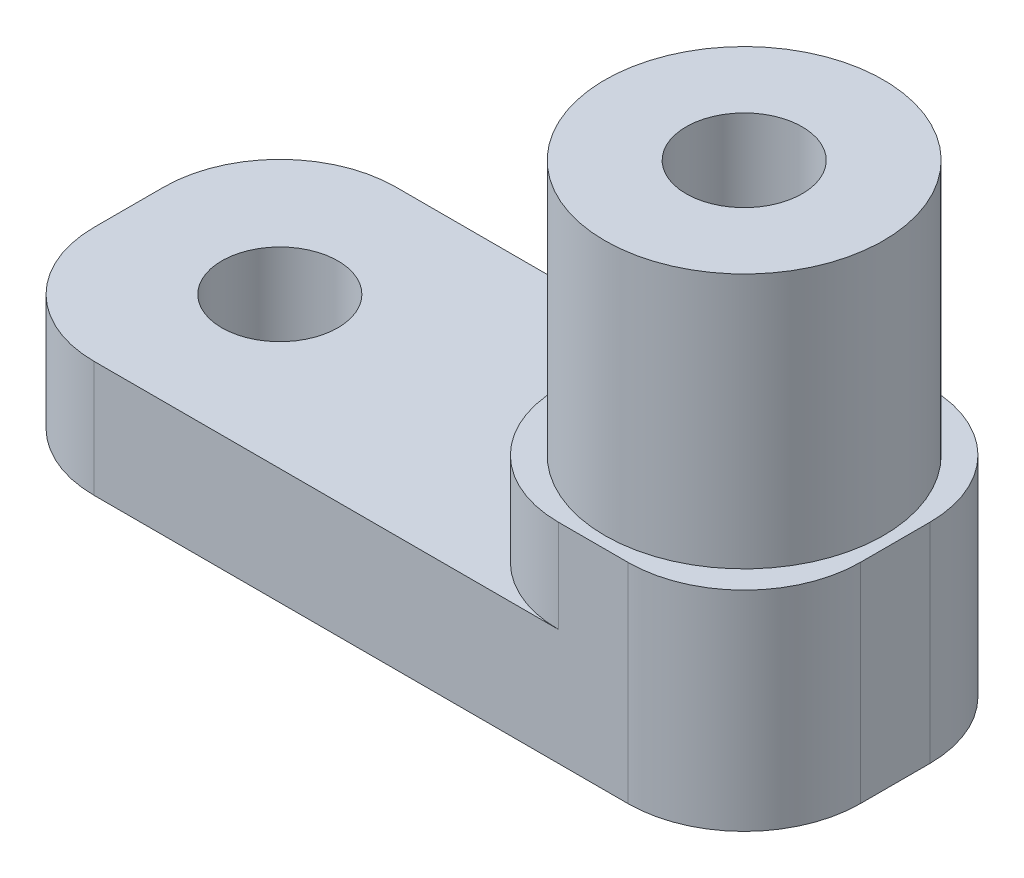
ISO-10303-21;
HEADER;
FILE_DESCRIPTION(('STEP AP214'),'2;1');
FILE_NAME('part.step','',(''),(''),'','','');
FILE_SCHEMA(('AUTOMOTIVE_DESIGN { 1 0 10303 214 1 1 1 1 }'));
ENDSEC;
DATA;
#1=APPLICATION_CONTEXT('core data for automotive mechanical design processes');
#2=APPLICATION_PROTOCOL_DEFINITION('international standard','automotive_design',2000,#1);
#3=PRODUCT_CONTEXT('',#1,'mechanical');
#4=PRODUCT('Part','Part','',(#3));
#5=PRODUCT_RELATED_PRODUCT_CATEGORY('part','',(#4));
#6=PRODUCT_DEFINITION_FORMATION('','',#4);
#7=PRODUCT_DEFINITION_CONTEXT('part definition',#1,'design');
#8=PRODUCT_DEFINITION('design','',#6,#7);
#9=PRODUCT_DEFINITION_SHAPE('','',#8);
#10=(LENGTH_UNIT() NAMED_UNIT(*) SI_UNIT(.MILLI.,.METRE.));
#11=(NAMED_UNIT(*) PLANE_ANGLE_UNIT() SI_UNIT($,.RADIAN.));
#12=(NAMED_UNIT(*) SI_UNIT($,.STERADIAN.) SOLID_ANGLE_UNIT());
#13=UNCERTAINTY_MEASURE_WITH_UNIT(LENGTH_MEASURE(1.E-05),#10,'distance_accuracy_value','');
#14=(GEOMETRIC_REPRESENTATION_CONTEXT(3) GLOBAL_UNCERTAINTY_ASSIGNED_CONTEXT((#13)) GLOBAL_UNIT_ASSIGNED_CONTEXT((#10,
#11,#12)) REPRESENTATION_CONTEXT('',''));
#15=CARTESIAN_POINT('',(0.,0.,0.));
#16=DIRECTION('',(0.,0.,1.));
#17=DIRECTION('',(1.,0.,0.));
#18=AXIS2_PLACEMENT_3D('',#15,#16,#17);
#19=CARTESIAN_POINT('',(0.,0.,0.));
#20=DIRECTION('',(0.,1.,0.));
#21=DIRECTION('',(0.,0.,1.));
#22=AXIS2_PLACEMENT_3D('',#19,#20,#21);
#23=PLANE('',#22);
#24=CARTESIAN_POINT('',(-20.,0.,0.));
#25=DIRECTION('',(0.,1.,0.));
#26=DIRECTION('',(0.,0.,1.));
#27=AXIS2_PLACEMENT_3D('',#24,#25,#26);
#28=CIRCLE('',#27,2.5);
#29=CARTESIAN_POINT('',(-20.,0.,2.5));
#30=VERTEX_POINT('',#29);
#31=EDGE_CURVE('E169',#30,#30,#28,.T.);
#32=ORIENTED_EDGE('',*,*,#31,.T.);
#33=EDGE_LOOP('',(#32));
#34=FACE_BOUND('',#33,.T.);
#35=CARTESIAN_POINT('',(0.,0.,0.));
#36=DIRECTION('',(0.,1.,0.));
#37=DIRECTION('',(0.,0.,1.));
#38=AXIS2_PLACEMENT_3D('',#35,#36,#37);
#39=CIRCLE('',#38,2.5);
#40=CARTESIAN_POINT('',(0.,0.,2.5));
#41=VERTEX_POINT('',#40);
#42=EDGE_CURVE('E175',#41,#41,#39,.T.);
#43=ORIENTED_EDGE('',*,*,#42,.T.);
#44=EDGE_LOOP('',(#43));
#45=FACE_BOUND('',#44,.T.);
#46=DIRECTION('',(0.,0.,-1.));
#47=VECTOR('',#46,1.);
#48=CARTESIAN_POINT('',(6.5,0.,0.));
#49=LINE('',#48,#47);
#50=CARTESIAN_POINT('',(6.5,0.,1.5));
#51=VERTEX_POINT('',#50);
#52=CARTESIAN_POINT('',(6.5,0.,-1.5));
#53=VERTEX_POINT('',#52);
#54=EDGE_CURVE('E192',#51,#53,#49,.T.);
#55=ORIENTED_EDGE('',*,*,#54,.F.);
#56=CARTESIAN_POINT('',(1.5,0.,1.5));
#57=DIRECTION('',(0.,1.,0.));
#58=DIRECTION('',(0.,0.,1.));
#59=AXIS2_PLACEMENT_3D('',#56,#57,#58);
#60=CIRCLE('',#59,5.);
#61=CARTESIAN_POINT('',(1.5,0.,6.5));
#62=VERTEX_POINT('',#61);
#63=EDGE_CURVE('E238',#51,#62,#60,.F.);
#64=ORIENTED_EDGE('',*,*,#63,.T.);
#65=DIRECTION('',(1.,0.,0.));
#66=VECTOR('',#65,1.);
#67=CARTESIAN_POINT('',(0.,0.,6.5));
#68=LINE('',#67,#66);
#69=CARTESIAN_POINT('',(-21.5,0.,6.5));
#70=VERTEX_POINT('',#69);
#71=EDGE_CURVE('E181',#70,#62,#68,.T.);
#72=ORIENTED_EDGE('',*,*,#71,.F.);
#73=CARTESIAN_POINT('',(-21.5,0.,1.5));
#74=DIRECTION('',(0.,1.,0.));
#75=DIRECTION('',(0.,0.,1.));
#76=AXIS2_PLACEMENT_3D('',#73,#74,#75);
#77=CIRCLE('',#76,5.);
#78=CARTESIAN_POINT('',(-26.5,0.,1.5));
#79=VERTEX_POINT('',#78);
#80=EDGE_CURVE('E232',#70,#79,#77,.F.);
#81=ORIENTED_EDGE('',*,*,#80,.T.);
#82=DIRECTION('',(0.,0.,-1.));
#83=VECTOR('',#82,1.);
#84=CARTESIAN_POINT('',(-26.5,0.,0.));
#85=LINE('',#84,#83);
#86=CARTESIAN_POINT('',(-26.5,0.,-1.5));
#87=VERTEX_POINT('',#86);
#88=EDGE_CURVE('E185',#79,#87,#85,.T.);
#89=ORIENTED_EDGE('',*,*,#88,.T.);
#90=CARTESIAN_POINT('',(-21.5,0.,-1.5));
#91=DIRECTION('',(0.,1.,0.));
#92=DIRECTION('',(0.,0.,1.));
#93=AXIS2_PLACEMENT_3D('',#90,#91,#92);
#94=CIRCLE('',#93,5.);
#95=CARTESIAN_POINT('',(-21.5,0.,-6.5));
#96=VERTEX_POINT('',#95);
#97=EDGE_CURVE('E234',#87,#96,#94,.F.);
#98=ORIENTED_EDGE('',*,*,#97,.T.);
#99=DIRECTION('',(1.,0.,0.));
#100=VECTOR('',#99,1.);
#101=CARTESIAN_POINT('',(0.,0.,-6.5));
#102=LINE('',#101,#100);
#103=CARTESIAN_POINT('',(1.5,0.,-6.5));
#104=VERTEX_POINT('',#103);
#105=EDGE_CURVE('E195',#96,#104,#102,.T.);
#106=ORIENTED_EDGE('',*,*,#105,.T.);
#107=CARTESIAN_POINT('',(1.5,0.,-1.5));
#108=DIRECTION('',(0.,1.,0.));
#109=DIRECTION('',(0.,0.,1.));
#110=AXIS2_PLACEMENT_3D('',#107,#108,#109);
#111=CIRCLE('',#110,5.);
#112=EDGE_CURVE('E236',#104,#53,#111,.F.);
#113=ORIENTED_EDGE('',*,*,#112,.T.);
#114=EDGE_LOOP('',(#55,#64,#72,#81,#89,#98,#106,#113));
#115=FACE_BOUND('',#114,.T.);
#116=CARTESIAN_POINT('',(-7.,0.,0.));
#117=DIRECTION('',(0.,-1.,0.));
#118=DIRECTION('',(0.,0.,-1.));
#119=AXIS2_PLACEMENT_3D('',#116,#117,#118);
#120=CIRCLE('',#119,1.64999999999999);
#121=CARTESIAN_POINT('',(-7.,0.,-1.64999999999999));
#122=VERTEX_POINT('',#121);
#123=EDGE_CURVE('E144',#122,#122,#120,.T.);
#124=ORIENTED_EDGE('',*,*,#123,.F.);
#125=EDGE_LOOP('',(#124));
#126=FACE_BOUND('',#125,.T.);
#127=ADVANCED_FACE('F42',(#34,#45,#115,#126),#23,.F.);
#128=CARTESIAN_POINT('',(0.,5.,0.));
#129=DIRECTION('',(0.,1.,0.));
#130=DIRECTION('',(0.,0.,1.));
#131=AXIS2_PLACEMENT_3D('',#128,#129,#130);
#132=PLANE('',#131);
#133=CARTESIAN_POINT('',(-20.,5.,0.));
#134=DIRECTION('',(0.,1.,0.));
#135=DIRECTION('',(0.,0.,1.));
#136=AXIS2_PLACEMENT_3D('',#133,#134,#135);
#137=CIRCLE('',#136,2.5);
#138=CARTESIAN_POINT('',(-20.,5.,2.5));
#139=VERTEX_POINT('',#138);
#140=EDGE_CURVE('E164',#139,#139,#137,.T.);
#141=ORIENTED_EDGE('',*,*,#140,.F.);
#142=EDGE_LOOP('',(#141));
#143=FACE_BOUND('',#142,.T.);
#144=DIRECTION('',(1.,0.,0.));
#145=VECTOR('',#144,1.);
#146=CARTESIAN_POINT('',(0.,5.,-6.5));
#147=LINE('',#146,#145);
#148=CARTESIAN_POINT('',(-21.5,5.,-6.5));
#149=VERTEX_POINT('',#148);
#150=CARTESIAN_POINT('',(-1.5,5.,-6.5));
#151=VERTEX_POINT('',#150);
#152=EDGE_CURVE('E184',#149,#151,#147,.T.);
#153=ORIENTED_EDGE('',*,*,#152,.F.);
#154=CARTESIAN_POINT('',(-21.5,5.,-1.5));
#155=DIRECTION('',(0.,1.,0.));
#156=DIRECTION('',(0.,0.,1.));
#157=AXIS2_PLACEMENT_3D('',#154,#155,#156);
#158=CIRCLE('',#157,5.);
#159=CARTESIAN_POINT('',(-26.5,5.,-1.5));
#160=VERTEX_POINT('',#159);
#161=EDGE_CURVE('E57',#149,#160,#158,.T.);
#162=ORIENTED_EDGE('',*,*,#161,.T.);
#163=DIRECTION('',(0.,0.,-1.));
#164=VECTOR('',#163,1.);
#165=CARTESIAN_POINT('',(-26.5,5.,0.));
#166=LINE('',#165,#164);
#167=CARTESIAN_POINT('',(-26.5,5.,1.5));
#168=VERTEX_POINT('',#167);
#169=EDGE_CURVE('E187',#168,#160,#166,.T.);
#170=ORIENTED_EDGE('',*,*,#169,.F.);
#171=CARTESIAN_POINT('',(-21.5,5.,1.5));
#172=DIRECTION('',(0.,1.,0.));
#173=DIRECTION('',(0.,0.,1.));
#174=AXIS2_PLACEMENT_3D('',#171,#172,#173);
#175=CIRCLE('',#174,5.);
#176=CARTESIAN_POINT('',(-21.5,5.,6.5));
#177=VERTEX_POINT('',#176);
#178=EDGE_CURVE('E244',#168,#177,#175,.T.);
#179=ORIENTED_EDGE('',*,*,#178,.T.);
#180=DIRECTION('',(1.,0.,0.));
#181=VECTOR('',#180,1.);
#182=CARTESIAN_POINT('',(0.,5.,6.5));
#183=LINE('',#182,#181);
#184=CARTESIAN_POINT('',(-1.5,5.,6.5));
#185=VERTEX_POINT('',#184);
#186=EDGE_CURVE('E182',#177,#185,#183,.T.);
#187=ORIENTED_EDGE('',*,*,#186,.T.);
#188=CARTESIAN_POINT('',(-1.5,5.,1.5));
#189=DIRECTION('',(0.,1.,0.));
#190=DIRECTION('',(0.,0.,1.));
#191=AXIS2_PLACEMENT_3D('',#188,#189,#190);
#192=CIRCLE('',#191,5.);
#193=CARTESIAN_POINT('',(-6.5,5.,1.5));
#194=VERTEX_POINT('',#193);
#195=EDGE_CURVE('E11',#185,#194,#192,.F.);
#196=ORIENTED_EDGE('',*,*,#195,.T.);
#197=DIRECTION('',(0.,0.,1.));
#198=VECTOR('',#197,1.);
#199=CARTESIAN_POINT('',(-6.5,5.,6.5));
#200=LINE('',#199,#198);
#201=CARTESIAN_POINT('',(-6.5,5.,-1.49999999999999));
#202=VERTEX_POINT('',#201);
#203=EDGE_CURVE('E147',#202,#194,#200,.T.);
#204=ORIENTED_EDGE('',*,*,#203,.F.);
#205=CARTESIAN_POINT('',(-1.5,5.,-1.5));
#206=DIRECTION('',(0.,1.,0.));
#207=DIRECTION('',(0.,0.,1.));
#208=AXIS2_PLACEMENT_3D('',#205,#206,#207);
#209=CIRCLE('',#208,5.);
#210=EDGE_CURVE('E50',#202,#151,#209,.F.);
#211=ORIENTED_EDGE('',*,*,#210,.T.);
#212=EDGE_LOOP('',(#153,#162,#170,#179,#187,#196,#204,#211));
#213=FACE_BOUND('',#212,.T.);
#214=ADVANCED_FACE('F249',(#143,#213),#132,.T.);
#215=CARTESIAN_POINT('',(0.,5.,6.5));
#216=DIRECTION('',(0.,0.,-1.));
#217=DIRECTION('',(-1.,0.,0.));
#218=AXIS2_PLACEMENT_3D('',#215,#216,#217);
#219=PLANE('',#218);
#220=DIRECTION('',(1.,0.,0.));
#221=VECTOR('',#220,1.);
#222=CARTESIAN_POINT('',(6.5,9.,6.5));
#223=LINE('',#222,#221);
#224=CARTESIAN_POINT('',(-1.5,9.,6.5));
#225=VERTEX_POINT('',#224);
#226=CARTESIAN_POINT('',(1.5,9.,6.5));
#227=VERTEX_POINT('',#226);
#228=EDGE_CURVE('E161',#225,#227,#223,.T.);
#229=ORIENTED_EDGE('',*,*,#228,.F.);
#230=DIRECTION('',(0.,-1.,0.));
#231=VECTOR('',#230,1.);
#232=CARTESIAN_POINT('',(-1.5,5.,6.5));
#233=LINE('',#232,#231);
#234=EDGE_CURVE('E224',#225,#185,#233,.T.);
#235=ORIENTED_EDGE('',*,*,#234,.T.);
#236=ORIENTED_EDGE('',*,*,#186,.F.);
#237=DIRECTION('',(0.,-1.,0.));
#238=VECTOR('',#237,1.);
#239=CARTESIAN_POINT('',(-21.5,0.,6.5));
#240=LINE('',#239,#238);
#241=EDGE_CURVE('E219',#177,#70,#240,.T.);
#242=ORIENTED_EDGE('',*,*,#241,.T.);
#243=ORIENTED_EDGE('',*,*,#71,.T.);
#244=DIRECTION('',(0.,-1.,0.));
#245=VECTOR('',#244,1.);
#246=CARTESIAN_POINT('',(1.5,5.,6.5));
#247=LINE('',#246,#245);
#248=EDGE_CURVE('E222',#62,#227,#247,.F.);
#249=ORIENTED_EDGE('',*,*,#248,.T.);
#250=EDGE_LOOP('',(#229,#235,#236,#242,#243,#249));
#251=FACE_BOUND('',#250,.T.);
#252=ADVANCED_FACE('F283',(#251),#219,.F.);
#253=CARTESIAN_POINT('',(6.5,5.,0.));
#254=DIRECTION('',(-1.,0.,0.));
#255=DIRECTION('',(0.,0.,1.));
#256=AXIS2_PLACEMENT_3D('',#253,#254,#255);
#257=PLANE('',#256);
#258=DIRECTION('',(0.,0.,-1.));
#259=VECTOR('',#258,1.);
#260=CARTESIAN_POINT('',(6.5,9.,6.5));
#261=LINE('',#260,#259);
#262=CARTESIAN_POINT('',(6.5,9.,1.5));
#263=VERTEX_POINT('',#262);
#264=CARTESIAN_POINT('',(6.5,9.,-1.5));
#265=VERTEX_POINT('',#264);
#266=EDGE_CURVE('E152',#263,#265,#261,.T.);
#267=ORIENTED_EDGE('',*,*,#266,.F.);
#268=DIRECTION('',(0.,-1.,0.));
#269=VECTOR('',#268,1.);
#270=CARTESIAN_POINT('',(6.5,5.,1.5));
#271=LINE('',#270,#269);
#272=EDGE_CURVE('E229',#263,#51,#271,.T.);
#273=ORIENTED_EDGE('',*,*,#272,.T.);
#274=ORIENTED_EDGE('',*,*,#54,.T.);
#275=DIRECTION('',(0.,-1.,0.));
#276=VECTOR('',#275,1.);
#277=CARTESIAN_POINT('',(6.5,9.,-1.5));
#278=LINE('',#277,#276);
#279=EDGE_CURVE('E227',#53,#265,#278,.F.);
#280=ORIENTED_EDGE('',*,*,#279,.T.);
#281=EDGE_LOOP('',(#267,#273,#274,#280));
#282=FACE_BOUND('',#281,.T.);
#283=ADVANCED_FACE('F290',(#282),#257,.F.);
#284=CARTESIAN_POINT('',(0.,5.,-6.5));
#285=DIRECTION('',(0.,0.,-1.));
#286=DIRECTION('',(-1.,0.,0.));
#287=AXIS2_PLACEMENT_3D('',#284,#285,#286);
#288=PLANE('',#287);
#289=ORIENTED_EDGE('',*,*,#152,.T.);
#290=DIRECTION('',(0.,-1.,0.));
#291=VECTOR('',#290,1.);
#292=CARTESIAN_POINT('',(-1.5,9.,-6.5));
#293=LINE('',#292,#291);
#294=CARTESIAN_POINT('',(-1.5,9.,-6.5));
#295=VERTEX_POINT('',#294);
#296=EDGE_CURVE('E209',#151,#295,#293,.F.);
#297=ORIENTED_EDGE('',*,*,#296,.T.);
#298=DIRECTION('',(-1.,0.,0.));
#299=VECTOR('',#298,1.);
#300=CARTESIAN_POINT('',(6.5,9.,-6.5));
#301=LINE('',#300,#299);
#302=CARTESIAN_POINT('',(1.5,9.,-6.5));
#303=VERTEX_POINT('',#302);
#304=EDGE_CURVE('E155',#303,#295,#301,.T.);
#305=ORIENTED_EDGE('',*,*,#304,.F.);
#306=DIRECTION('',(0.,-1.,0.));
#307=VECTOR('',#306,1.);
#308=CARTESIAN_POINT('',(1.5,0.,-6.5));
#309=LINE('',#308,#307);
#310=EDGE_CURVE('E206',#303,#104,#309,.T.);
#311=ORIENTED_EDGE('',*,*,#310,.T.);
#312=ORIENTED_EDGE('',*,*,#105,.F.);
#313=DIRECTION('',(0.,-1.,0.));
#314=VECTOR('',#313,1.);
#315=CARTESIAN_POINT('',(-21.5,5.,-6.5));
#316=LINE('',#315,#314);
#317=EDGE_CURVE('E204',#96,#149,#316,.F.);
#318=ORIENTED_EDGE('',*,*,#317,.T.);
#319=EDGE_LOOP('',(#289,#297,#305,#311,#312,#318));
#320=FACE_BOUND('',#319,.T.);
#321=ADVANCED_FACE('F256',(#320),#288,.T.);
#322=CARTESIAN_POINT('',(-26.5,5.,0.));
#323=DIRECTION('',(-1.,0.,0.));
#324=DIRECTION('',(0.,0.,1.));
#325=AXIS2_PLACEMENT_3D('',#322,#323,#324);
#326=PLANE('',#325);
#327=ORIENTED_EDGE('',*,*,#169,.T.);
#328=DIRECTION('',(0.,-1.,0.));
#329=VECTOR('',#328,1.);
#330=CARTESIAN_POINT('',(-26.5,5.,-1.5));
#331=LINE('',#330,#329);
#332=EDGE_CURVE('E241',#160,#87,#331,.T.);
#333=ORIENTED_EDGE('',*,*,#332,.T.);
#334=ORIENTED_EDGE('',*,*,#88,.F.);
#335=DIRECTION('',(0.,-1.,0.));
#336=VECTOR('',#335,1.);
#337=CARTESIAN_POINT('',(-26.5,5.,1.5));
#338=LINE('',#337,#336);
#339=EDGE_CURVE('E64',#79,#168,#338,.F.);
#340=ORIENTED_EDGE('',*,*,#339,.T.);
#341=EDGE_LOOP('',(#327,#333,#334,#340));
#342=FACE_BOUND('',#341,.T.);
#343=ADVANCED_FACE('F275',(#342),#326,.T.);
#344=CARTESIAN_POINT('',(0.,20.,0.));
#345=DIRECTION('',(0.,-1.,0.));
#346=DIRECTION('',(0.,0.,-1.));
#347=AXIS2_PLACEMENT_3D('',#344,#345,#346);
#348=CYLINDRICAL_SURFACE('',#347,6.);
#349=CARTESIAN_POINT('',(0.,9.,0.));
#350=DIRECTION('',(0.,1.,0.));
#351=DIRECTION('',(0.,0.,1.));
#352=AXIS2_PLACEMENT_3D('',#349,#350,#351);
#353=CIRCLE('',#352,6.);
#354=CARTESIAN_POINT('',(0.,9.,6.));
#355=VERTEX_POINT('',#354);
#356=EDGE_CURVE('E143',#355,#355,#353,.T.);
#357=ORIENTED_EDGE('',*,*,#356,.T.);
#358=EDGE_LOOP('',(#357));
#359=FACE_BOUND('',#358,.T.);
#360=CARTESIAN_POINT('',(0.,20.,0.));
#361=DIRECTION('',(0.,1.,0.));
#362=DIRECTION('',(0.,0.,1.));
#363=AXIS2_PLACEMENT_3D('',#360,#361,#362);
#364=CIRCLE('',#363,6.);
#365=CARTESIAN_POINT('',(0.,20.,6.));
#366=VERTEX_POINT('',#365);
#367=EDGE_CURVE('E178',#366,#366,#364,.T.);
#368=ORIENTED_EDGE('',*,*,#367,.F.);
#369=EDGE_LOOP('',(#368));
#370=FACE_BOUND('',#369,.T.);
#371=ADVANCED_FACE('F311',(#359,#370),#348,.T.);
#372=CARTESIAN_POINT('',(0.,20.,0.));
#373=DIRECTION('',(0.,1.,0.));
#374=DIRECTION('',(0.,0.,1.));
#375=AXIS2_PLACEMENT_3D('',#372,#373,#374);
#376=PLANE('',#375);
#377=CARTESIAN_POINT('',(0.,20.,0.));
#378=DIRECTION('',(0.,1.,0.));
#379=DIRECTION('',(0.,0.,1.));
#380=AXIS2_PLACEMENT_3D('',#377,#378,#379);
#381=CIRCLE('',#380,2.49999999999999);
#382=CARTESIAN_POINT('',(0.,20.,2.49999999999999));
#383=VERTEX_POINT('',#382);
#384=EDGE_CURVE('E172',#383,#383,#381,.T.);
#385=ORIENTED_EDGE('',*,*,#384,.F.);
#386=EDGE_LOOP('',(#385));
#387=FACE_BOUND('',#386,.T.);
#388=ORIENTED_EDGE('',*,*,#367,.T.);
#389=EDGE_LOOP('',(#388));
#390=FACE_BOUND('',#389,.T.);
#391=ADVANCED_FACE('F315',(#387,#390),#376,.T.);
#392=CARTESIAN_POINT('',(0.,20.,0.));
#393=DIRECTION('',(0.,1.,0.));
#394=DIRECTION('',(0.,0.,1.));
#395=AXIS2_PLACEMENT_3D('',#392,#393,#394);
#396=CYLINDRICAL_SURFACE('',#395,2.49999999999999);
#397=ORIENTED_EDGE('',*,*,#42,.F.);
#398=EDGE_LOOP('',(#397));
#399=FACE_BOUND('',#398,.T.);
#400=ORIENTED_EDGE('',*,*,#384,.T.);
#401=EDGE_LOOP('',(#400));
#402=FACE_BOUND('',#401,.T.);
#403=ADVANCED_FACE('F320',(#399,#402),#396,.F.);
#404=CARTESIAN_POINT('',(-20.,5.,0.));
#405=DIRECTION('',(0.,1.,0.));
#406=DIRECTION('',(0.,0.,1.));
#407=AXIS2_PLACEMENT_3D('',#404,#405,#406);
#408=CYLINDRICAL_SURFACE('',#407,2.5);
#409=ORIENTED_EDGE('',*,*,#31,.F.);
#410=EDGE_LOOP('',(#409));
#411=FACE_BOUND('',#410,.T.);
#412=ORIENTED_EDGE('',*,*,#140,.T.);
#413=EDGE_LOOP('',(#412));
#414=FACE_BOUND('',#413,.T.);
#415=ADVANCED_FACE('F327',(#411,#414),#408,.F.);
#416=CARTESIAN_POINT('',(0.,9.,0.));
#417=DIRECTION('',(0.,1.,0.));
#418=DIRECTION('',(0.,0.,1.));
#419=AXIS2_PLACEMENT_3D('',#416,#417,#418);
#420=PLANE('',#419);
#421=ORIENTED_EDGE('',*,*,#304,.T.);
#422=CARTESIAN_POINT('',(-1.5,9.,-1.5));
#423=DIRECTION('',(0.,1.,0.));
#424=DIRECTION('',(0.,0.,1.));
#425=AXIS2_PLACEMENT_3D('',#422,#423,#424);
#426=CIRCLE('',#425,5.);
#427=CARTESIAN_POINT('',(-6.5,9.,-1.49999999999999));
#428=VERTEX_POINT('',#427);
#429=EDGE_CURVE('E217',#295,#428,#426,.T.);
#430=ORIENTED_EDGE('',*,*,#429,.T.);
#431=DIRECTION('',(0.,0.,1.));
#432=VECTOR('',#431,1.);
#433=CARTESIAN_POINT('',(-6.5,9.,6.5));
#434=LINE('',#433,#432);
#435=CARTESIAN_POINT('',(-6.5,9.,1.5));
#436=VERTEX_POINT('',#435);
#437=EDGE_CURVE('E158',#428,#436,#434,.T.);
#438=ORIENTED_EDGE('',*,*,#437,.T.);
#439=CARTESIAN_POINT('',(-1.5,9.,1.5));
#440=DIRECTION('',(0.,1.,0.));
#441=DIRECTION('',(0.,0.,1.));
#442=AXIS2_PLACEMENT_3D('',#439,#440,#441);
#443=CIRCLE('',#442,5.);
#444=EDGE_CURVE('E215',#436,#225,#443,.T.);
#445=ORIENTED_EDGE('',*,*,#444,.T.);
#446=ORIENTED_EDGE('',*,*,#228,.T.);
#447=CARTESIAN_POINT('',(1.5,9.,1.5));
#448=DIRECTION('',(0.,1.,0.));
#449=DIRECTION('',(0.,0.,1.));
#450=AXIS2_PLACEMENT_3D('',#447,#448,#449);
#451=CIRCLE('',#450,5.);
#452=EDGE_CURVE('E213',#227,#263,#451,.T.);
#453=ORIENTED_EDGE('',*,*,#452,.T.);
#454=ORIENTED_EDGE('',*,*,#266,.T.);
#455=CARTESIAN_POINT('',(1.5,9.,-1.5));
#456=DIRECTION('',(0.,1.,0.));
#457=DIRECTION('',(0.,0.,1.));
#458=AXIS2_PLACEMENT_3D('',#455,#456,#457);
#459=CIRCLE('',#458,5.);
#460=EDGE_CURVE('E211',#265,#303,#459,.T.);
#461=ORIENTED_EDGE('',*,*,#460,.T.);
#462=EDGE_LOOP('',(#421,#430,#438,#445,#446,#453,#454,#461));
#463=FACE_BOUND('',#462,.T.);
#464=ORIENTED_EDGE('',*,*,#356,.F.);
#465=EDGE_LOOP('',(#464));
#466=FACE_BOUND('',#465,.T.);
#467=ADVANCED_FACE('F259',(#463,#466),#420,.T.);
#468=CARTESIAN_POINT('',(-6.5,9.,6.5));
#469=DIRECTION('',(1.,0.,0.));
#470=DIRECTION('',(0.,0.,-1.));
#471=AXIS2_PLACEMENT_3D('',#468,#469,#470);
#472=PLANE('',#471);
#473=ORIENTED_EDGE('',*,*,#437,.F.);
#474=DIRECTION('',(0.,-1.,0.));
#475=VECTOR('',#474,1.);
#476=CARTESIAN_POINT('',(-6.5,5.,-1.5));
#477=LINE('',#476,#475);
#478=EDGE_CURVE('E201',#428,#202,#477,.T.);
#479=ORIENTED_EDGE('',*,*,#478,.T.);
#480=ORIENTED_EDGE('',*,*,#203,.T.);
#481=DIRECTION('',(0.,-1.,0.));
#482=VECTOR('',#481,1.);
#483=CARTESIAN_POINT('',(-6.5,9.,1.5));
#484=LINE('',#483,#482);
#485=EDGE_CURVE('E189',#194,#436,#484,.F.);
#486=ORIENTED_EDGE('',*,*,#485,.T.);
#487=EDGE_LOOP('',(#473,#479,#480,#486));
#488=FACE_BOUND('',#487,.T.);
#489=ADVANCED_FACE('F137',(#488),#472,.F.);
#490=CARTESIAN_POINT('',(-7.,4.,0.));
#491=DIRECTION('',(0.,-1.,0.));
#492=DIRECTION('',(0.,0.,-1.));
#493=AXIS2_PLACEMENT_3D('',#490,#491,#492);
#494=CONICAL_SURFACE('',#493,1.65,1.02974425867665);
#495=CARTESIAN_POINT('',(-7.,4.99142002139547,0.));
#496=VERTEX_POINT('',#495);
#497=VERTEX_LOOP('',#496);
#498=FACE_BOUND('',#497,.T.);
#499=CARTESIAN_POINT('',(-7.,4.,0.));
#500=DIRECTION('',(0.,-1.,0.));
#501=DIRECTION('',(0.,0.,-1.));
#502=AXIS2_PLACEMENT_3D('',#499,#500,#501);
#503=CIRCLE('',#502,1.65);
#504=CARTESIAN_POINT('',(-7.,4.,-1.65));
#505=VERTEX_POINT('',#504);
#506=EDGE_CURVE('E141',#505,#505,#503,.T.);
#507=ORIENTED_EDGE('',*,*,#506,.T.);
#508=EDGE_LOOP('',(#507));
#509=FACE_BOUND('',#508,.T.);
#510=ADVANCED_FACE('F133',(#498,#509),#494,.F.);
#511=CARTESIAN_POINT('',(-7.,0.,0.));
#512=DIRECTION('',(0.,-1.,0.));
#513=DIRECTION('',(0.,0.,-1.));
#514=AXIS2_PLACEMENT_3D('',#511,#512,#513);
#515=CYLINDRICAL_SURFACE('',#514,1.64999999999999);
#516=ORIENTED_EDGE('',*,*,#506,.F.);
#517=EDGE_LOOP('',(#516));
#518=FACE_BOUND('',#517,.T.);
#519=ORIENTED_EDGE('',*,*,#123,.T.);
#520=EDGE_LOOP('',(#519));
#521=FACE_BOUND('',#520,.T.);
#522=ADVANCED_FACE('F136',(#518,#521),#515,.F.);
#523=CARTESIAN_POINT('',(-1.5,9.,-1.5));
#524=DIRECTION('',(0.,1.,0.));
#525=DIRECTION('',(0.,0.,1.));
#526=AXIS2_PLACEMENT_3D('',#523,#524,#525);
#527=CYLINDRICAL_SURFACE('',#526,5.);
#528=ORIENTED_EDGE('',*,*,#429,.F.);
#529=ORIENTED_EDGE('',*,*,#296,.F.);
#530=ORIENTED_EDGE('',*,*,#210,.F.);
#531=ORIENTED_EDGE('',*,*,#478,.F.);
#532=EDGE_LOOP('',(#528,#529,#530,#531));
#533=FACE_BOUND('',#532,.T.);
#534=ADVANCED_FACE('F253',(#533),#527,.T.);
#535=CARTESIAN_POINT('',(-1.5,5.,1.5));
#536=DIRECTION('',(0.,-1.,0.));
#537=DIRECTION('',(0.,0.,-1.));
#538=AXIS2_PLACEMENT_3D('',#535,#536,#537);
#539=CYLINDRICAL_SURFACE('',#538,5.);
#540=ORIENTED_EDGE('',*,*,#444,.F.);
#541=ORIENTED_EDGE('',*,*,#485,.F.);
#542=ORIENTED_EDGE('',*,*,#195,.F.);
#543=ORIENTED_EDGE('',*,*,#234,.F.);
#544=EDGE_LOOP('',(#540,#541,#542,#543));
#545=FACE_BOUND('',#544,.T.);
#546=ADVANCED_FACE('F341',(#545),#539,.T.);
#547=CARTESIAN_POINT('',(1.5,5.,1.5));
#548=DIRECTION('',(0.,-1.,0.));
#549=DIRECTION('',(0.,0.,-1.));
#550=AXIS2_PLACEMENT_3D('',#547,#548,#549);
#551=CYLINDRICAL_SURFACE('',#550,5.);
#552=ORIENTED_EDGE('',*,*,#452,.F.);
#553=ORIENTED_EDGE('',*,*,#248,.F.);
#554=ORIENTED_EDGE('',*,*,#63,.F.);
#555=ORIENTED_EDGE('',*,*,#272,.F.);
#556=EDGE_LOOP('',(#552,#553,#554,#555));
#557=FACE_BOUND('',#556,.T.);
#558=ADVANCED_FACE('F288',(#557),#551,.T.);
#559=CARTESIAN_POINT('',(1.5,5.,-1.5));
#560=DIRECTION('',(0.,1.,0.));
#561=DIRECTION('',(0.,0.,1.));
#562=AXIS2_PLACEMENT_3D('',#559,#560,#561);
#563=CYLINDRICAL_SURFACE('',#562,5.);
#564=ORIENTED_EDGE('',*,*,#460,.F.);
#565=ORIENTED_EDGE('',*,*,#279,.F.);
#566=ORIENTED_EDGE('',*,*,#112,.F.);
#567=ORIENTED_EDGE('',*,*,#310,.F.);
#568=EDGE_LOOP('',(#564,#565,#566,#567));
#569=FACE_BOUND('',#568,.T.);
#570=ADVANCED_FACE('F266',(#569),#563,.T.);
#571=CARTESIAN_POINT('',(-21.5,5.,-1.5));
#572=DIRECTION('',(0.,-1.,0.));
#573=DIRECTION('',(0.,0.,-1.));
#574=AXIS2_PLACEMENT_3D('',#571,#572,#573);
#575=CYLINDRICAL_SURFACE('',#574,5.);
#576=ORIENTED_EDGE('',*,*,#161,.F.);
#577=ORIENTED_EDGE('',*,*,#317,.F.);
#578=ORIENTED_EDGE('',*,*,#97,.F.);
#579=ORIENTED_EDGE('',*,*,#332,.F.);
#580=EDGE_LOOP('',(#576,#577,#578,#579));
#581=FACE_BOUND('',#580,.T.);
#582=ADVANCED_FACE('F274',(#581),#575,.T.);
#583=CARTESIAN_POINT('',(-21.5,5.,1.5));
#584=DIRECTION('',(0.,1.,0.));
#585=DIRECTION('',(0.,0.,1.));
#586=AXIS2_PLACEMENT_3D('',#583,#584,#585);
#587=CYLINDRICAL_SURFACE('',#586,5.);
#588=ORIENTED_EDGE('',*,*,#178,.F.);
#589=ORIENTED_EDGE('',*,*,#339,.F.);
#590=ORIENTED_EDGE('',*,*,#80,.F.);
#591=ORIENTED_EDGE('',*,*,#241,.F.);
#592=EDGE_LOOP('',(#588,#589,#590,#591));
#593=FACE_BOUND('',#592,.T.);
#594=ADVANCED_FACE('F44',(#593),#587,.T.);
#595=CLOSED_SHELL('',(#127,#214,#252,#283,#321,#343,#371,#391,#403,#415,#467,#489,#510,#522,
#534,#546,#558,#570,#582,#594));
#596=MANIFOLD_SOLID_BREP('B2',#595);
#597=ADVANCED_BREP_SHAPE_REPRESENTATION('',(#18,#596),#14);
#598=SHAPE_DEFINITION_REPRESENTATION(#9,#597);
ENDSEC;
END-ISO-10303-21;
